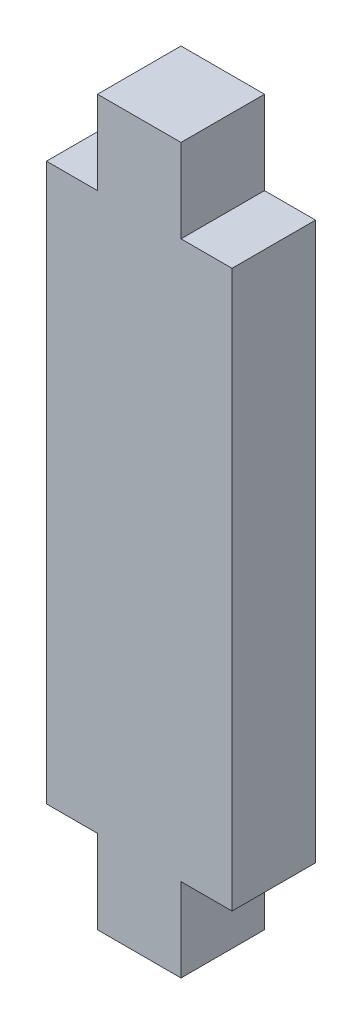
ISO-10303-21;
HEADER;
FILE_DESCRIPTION(('STEP AP214'),'2;1');
FILE_NAME('part.step','',(''),(''),'','','');
FILE_SCHEMA(('AUTOMOTIVE_DESIGN { 1 0 10303 214 1 1 1 1 }'));
ENDSEC;
DATA;
#1=APPLICATION_CONTEXT('core data for automotive mechanical design processes');
#2=APPLICATION_PROTOCOL_DEFINITION('international standard','automotive_design',2000,#1);
#3=PRODUCT_CONTEXT('',#1,'mechanical');
#4=PRODUCT('Part','Part','',(#3));
#5=PRODUCT_RELATED_PRODUCT_CATEGORY('part','',(#4));
#6=PRODUCT_DEFINITION_FORMATION('','',#4);
#7=PRODUCT_DEFINITION_CONTEXT('part definition',#1,'design');
#8=PRODUCT_DEFINITION('design','',#6,#7);
#9=PRODUCT_DEFINITION_SHAPE('','',#8);
#10=(LENGTH_UNIT() NAMED_UNIT(*) SI_UNIT(.MILLI.,.METRE.));
#11=(NAMED_UNIT(*) PLANE_ANGLE_UNIT() SI_UNIT($,.RADIAN.));
#12=(NAMED_UNIT(*) SI_UNIT($,.STERADIAN.) SOLID_ANGLE_UNIT());
#13=UNCERTAINTY_MEASURE_WITH_UNIT(LENGTH_MEASURE(1.E-05),#10,'distance_accuracy_value','');
#14=(GEOMETRIC_REPRESENTATION_CONTEXT(3) GLOBAL_UNCERTAINTY_ASSIGNED_CONTEXT((#13)) GLOBAL_UNIT_ASSIGNED_CONTEXT((#10,
#11,#12)) REPRESENTATION_CONTEXT('',''));
#15=CARTESIAN_POINT('',(0.,0.,0.));
#16=DIRECTION('',(0.,0.,1.));
#17=DIRECTION('',(1.,0.,0.));
#18=AXIS2_PLACEMENT_3D('',#15,#16,#17);
#19=CARTESIAN_POINT('',(2.25,0.,-2.25));
#20=DIRECTION('',(-1.,0.,0.));
#21=DIRECTION('',(0.,-1.,0.));
#22=AXIS2_PLACEMENT_3D('',#19,#20,#21);
#23=PLANE('',#22);
#24=DIRECTION('',(0.,-1.,0.));
#25=VECTOR('',#24,1.);
#26=CARTESIAN_POINT('',(2.25,0.,2.25));
#27=LINE('',#26,#25);
#28=CARTESIAN_POINT('',(2.25,19.5,2.25));
#29=VERTEX_POINT('',#28);
#30=CARTESIAN_POINT('',(2.25,15.,2.25));
#31=VERTEX_POINT('',#30);
#32=EDGE_CURVE('E130',#29,#31,#27,.T.);
#33=ORIENTED_EDGE('',*,*,#32,.T.);
#34=DIRECTION('',(0.,0.,1.));
#35=VECTOR('',#34,1.);
#36=CARTESIAN_POINT('',(2.25,15.,-2.25));
#37=LINE('',#36,#35);
#38=CARTESIAN_POINT('',(2.25,15.,-2.25));
#39=VERTEX_POINT('',#38);
#40=EDGE_CURVE('E11',#39,#31,#37,.T.);
#41=ORIENTED_EDGE('',*,*,#40,.F.);
#42=DIRECTION('',(0.,-1.,0.));
#43=VECTOR('',#42,1.);
#44=CARTESIAN_POINT('',(2.25,0.,-2.25));
#45=LINE('',#44,#43);
#46=CARTESIAN_POINT('',(2.25,19.5,-2.25));
#47=VERTEX_POINT('',#46);
#48=EDGE_CURVE('E156',#47,#39,#45,.T.);
#49=ORIENTED_EDGE('',*,*,#48,.F.);
#50=DIRECTION('',(0.,0.,1.));
#51=VECTOR('',#50,1.);
#52=CARTESIAN_POINT('',(2.25,19.5,-2.25));
#53=LINE('',#52,#51);
#54=EDGE_CURVE('E37',#47,#29,#53,.T.);
#55=ORIENTED_EDGE('',*,*,#54,.T.);
#56=EDGE_LOOP('',(#33,#41,#49,#55));
#57=FACE_BOUND('',#56,.T.);
#58=ADVANCED_FACE('F34',(#57),#23,.F.);
#59=CARTESIAN_POINT('',(0.,15.,-2.25));
#60=DIRECTION('',(0.,-1.,0.));
#61=DIRECTION('',(0.,0.,-1.));
#62=AXIS2_PLACEMENT_3D('',#59,#60,#61);
#63=PLANE('',#62);
#64=DIRECTION('',(1.,0.,0.));
#65=VECTOR('',#64,1.);
#66=CARTESIAN_POINT('',(0.,15.,2.25));
#67=LINE('',#66,#65);
#68=CARTESIAN_POINT('',(5.,15.,2.25));
#69=VERTEX_POINT('',#68);
#70=EDGE_CURVE('E72',#31,#69,#67,.T.);
#71=ORIENTED_EDGE('',*,*,#70,.T.);
#72=DIRECTION('',(0.,0.,1.));
#73=VECTOR('',#72,1.);
#74=CARTESIAN_POINT('',(5.,15.,-2.25));
#75=LINE('',#74,#73);
#76=CARTESIAN_POINT('',(5.,15.,-2.25));
#77=VERTEX_POINT('',#76);
#78=EDGE_CURVE('E43',#77,#69,#75,.T.);
#79=ORIENTED_EDGE('',*,*,#78,.F.);
#80=DIRECTION('',(1.,0.,0.));
#81=VECTOR('',#80,1.);
#82=CARTESIAN_POINT('',(0.,15.,-2.25));
#83=LINE('',#82,#81);
#84=EDGE_CURVE('E51',#39,#77,#83,.T.);
#85=ORIENTED_EDGE('',*,*,#84,.F.);
#86=ORIENTED_EDGE('',*,*,#40,.T.);
#87=EDGE_LOOP('',(#71,#79,#85,#86));
#88=FACE_BOUND('',#87,.T.);
#89=ADVANCED_FACE('F158',(#88),#63,.F.);
#90=CARTESIAN_POINT('',(5.,0.,-2.25));
#91=DIRECTION('',(-1.,0.,0.));
#92=DIRECTION('',(0.,-1.,0.));
#93=AXIS2_PLACEMENT_3D('',#90,#91,#92);
#94=PLANE('',#93);
#95=DIRECTION('',(0.,-1.,0.));
#96=VECTOR('',#95,1.);
#97=CARTESIAN_POINT('',(5.,0.,2.25));
#98=LINE('',#97,#96);
#99=CARTESIAN_POINT('',(5.,-15.,2.25));
#100=VERTEX_POINT('',#99);
#101=EDGE_CURVE('E142',#69,#100,#98,.T.);
#102=ORIENTED_EDGE('',*,*,#101,.T.);
#103=DIRECTION('',(0.,0.,1.));
#104=VECTOR('',#103,1.);
#105=CARTESIAN_POINT('',(5.,-15.,-2.25));
#106=LINE('',#105,#104);
#107=CARTESIAN_POINT('',(5.,-15.,-2.25));
#108=VERTEX_POINT('',#107);
#109=EDGE_CURVE('E162',#108,#100,#106,.T.);
#110=ORIENTED_EDGE('',*,*,#109,.F.);
#111=DIRECTION('',(0.,-1.,0.));
#112=VECTOR('',#111,1.);
#113=CARTESIAN_POINT('',(5.,0.,-2.25));
#114=LINE('',#113,#112);
#115=EDGE_CURVE('E124',#77,#108,#114,.T.);
#116=ORIENTED_EDGE('',*,*,#115,.F.);
#117=ORIENTED_EDGE('',*,*,#78,.T.);
#118=EDGE_LOOP('',(#102,#110,#116,#117));
#119=FACE_BOUND('',#118,.T.);
#120=ADVANCED_FACE('F160',(#119),#94,.F.);
#121=CARTESIAN_POINT('',(-5.,0.,-2.25));
#122=DIRECTION('',(-1.,0.,0.));
#123=DIRECTION('',(0.,-1.,0.));
#124=AXIS2_PLACEMENT_3D('',#121,#122,#123);
#125=PLANE('',#124);
#126=DIRECTION('',(0.,-1.,0.));
#127=VECTOR('',#126,1.);
#128=CARTESIAN_POINT('',(-5.,0.,2.25));
#129=LINE('',#128,#127);
#130=CARTESIAN_POINT('',(-5.,15.,2.25));
#131=VERTEX_POINT('',#130);
#132=CARTESIAN_POINT('',(-5.,-15.,2.25));
#133=VERTEX_POINT('',#132);
#134=EDGE_CURVE('E107',#131,#133,#129,.T.);
#135=ORIENTED_EDGE('',*,*,#134,.F.);
#136=DIRECTION('',(0.,0.,1.));
#137=VECTOR('',#136,1.);
#138=CARTESIAN_POINT('',(-5.,15.,-2.25));
#139=LINE('',#138,#137);
#140=CARTESIAN_POINT('',(-5.,15.,-2.25));
#141=VERTEX_POINT('',#140);
#142=EDGE_CURVE('E98',#141,#131,#139,.T.);
#143=ORIENTED_EDGE('',*,*,#142,.F.);
#144=DIRECTION('',(0.,-1.,0.));
#145=VECTOR('',#144,1.);
#146=CARTESIAN_POINT('',(-5.,0.,-2.25));
#147=LINE('',#146,#145);
#148=CARTESIAN_POINT('',(-5.,-15.,-2.25));
#149=VERTEX_POINT('',#148);
#150=EDGE_CURVE('E104',#141,#149,#147,.T.);
#151=ORIENTED_EDGE('',*,*,#150,.T.);
#152=DIRECTION('',(0.,0.,1.));
#153=VECTOR('',#152,1.);
#154=CARTESIAN_POINT('',(-5.,-15.,-2.25));
#155=LINE('',#154,#153);
#156=EDGE_CURVE('E169',#149,#133,#155,.T.);
#157=ORIENTED_EDGE('',*,*,#156,.T.);
#158=EDGE_LOOP('',(#135,#143,#151,#157));
#159=FACE_BOUND('',#158,.T.);
#160=ADVANCED_FACE('F100',(#159),#125,.T.);
#161=CARTESIAN_POINT('',(-2.25,15.,2.25));
#162=VERTEX_POINT('',#161);
#163=EDGE_CURVE('E139',#131,#162,#67,.T.);
#164=ORIENTED_EDGE('',*,*,#163,.T.);
#165=DIRECTION('',(0.,0.,1.));
#166=VECTOR('',#165,1.);
#167=CARTESIAN_POINT('',(-2.25,15.,-2.25));
#168=LINE('',#167,#166);
#169=CARTESIAN_POINT('',(-2.25,15.,-2.25));
#170=VERTEX_POINT('',#169);
#171=EDGE_CURVE('E111',#170,#162,#168,.T.);
#172=ORIENTED_EDGE('',*,*,#171,.F.);
#173=EDGE_CURVE('E114',#141,#170,#83,.T.);
#174=ORIENTED_EDGE('',*,*,#173,.F.);
#175=ORIENTED_EDGE('',*,*,#142,.T.);
#176=EDGE_LOOP('',(#164,#172,#174,#175));
#177=FACE_BOUND('',#176,.T.);
#178=ADVANCED_FACE('F115',(#177),#63,.F.);
#179=CARTESIAN_POINT('',(-2.25,0.,-2.25));
#180=DIRECTION('',(-1.,0.,0.));
#181=DIRECTION('',(0.,-1.,0.));
#182=AXIS2_PLACEMENT_3D('',#179,#180,#181);
#183=PLANE('',#182);
#184=DIRECTION('',(0.,-1.,0.));
#185=VECTOR('',#184,1.);
#186=CARTESIAN_POINT('',(-2.25,0.,2.25));
#187=LINE('',#186,#185);
#188=CARTESIAN_POINT('',(-2.25,19.5,2.25));
#189=VERTEX_POINT('',#188);
#190=EDGE_CURVE('E136',#189,#162,#187,.T.);
#191=ORIENTED_EDGE('',*,*,#190,.F.);
#192=DIRECTION('',(0.,0.,1.));
#193=VECTOR('',#192,1.);
#194=CARTESIAN_POINT('',(-2.25,19.5,-2.25));
#195=LINE('',#194,#193);
#196=CARTESIAN_POINT('',(-2.25,19.5,-2.25));
#197=VERTEX_POINT('',#196);
#198=EDGE_CURVE('E146',#197,#189,#195,.T.);
#199=ORIENTED_EDGE('',*,*,#198,.F.);
#200=DIRECTION('',(0.,-1.,0.));
#201=VECTOR('',#200,1.);
#202=CARTESIAN_POINT('',(-2.25,0.,-2.25));
#203=LINE('',#202,#201);
#204=EDGE_CURVE('E117',#197,#170,#203,.T.);
#205=ORIENTED_EDGE('',*,*,#204,.T.);
#206=ORIENTED_EDGE('',*,*,#171,.T.);
#207=EDGE_LOOP('',(#191,#199,#205,#206));
#208=FACE_BOUND('',#207,.T.);
#209=ADVANCED_FACE('F209',(#208),#183,.T.);
#210=CARTESIAN_POINT('',(0.,19.5,-2.25));
#211=DIRECTION('',(0.,-1.,0.));
#212=DIRECTION('',(0.,0.,-1.));
#213=AXIS2_PLACEMENT_3D('',#210,#211,#212);
#214=PLANE('',#213);
#215=DIRECTION('',(1.,0.,0.));
#216=VECTOR('',#215,1.);
#217=CARTESIAN_POINT('',(0.,19.5,2.25));
#218=LINE('',#217,#216);
#219=EDGE_CURVE('E133',#189,#29,#218,.T.);
#220=ORIENTED_EDGE('',*,*,#219,.T.);
#221=ORIENTED_EDGE('',*,*,#54,.F.);
#222=DIRECTION('',(1.,0.,0.));
#223=VECTOR('',#222,1.);
#224=CARTESIAN_POINT('',(0.,19.5,-2.25));
#225=LINE('',#224,#223);
#226=EDGE_CURVE('E84',#197,#47,#225,.T.);
#227=ORIENTED_EDGE('',*,*,#226,.F.);
#228=ORIENTED_EDGE('',*,*,#198,.T.);
#229=EDGE_LOOP('',(#220,#221,#227,#228));
#230=FACE_BOUND('',#229,.T.);
#231=ADVANCED_FACE('F210',(#230),#214,.F.);
#232=CARTESIAN_POINT('',(0.,0.,-2.25));
#233=DIRECTION('',(0.,0.,1.));
#234=DIRECTION('',(1.,0.,0.));
#235=AXIS2_PLACEMENT_3D('',#232,#233,#234);
#236=PLANE('',#235);
#237=ORIENTED_EDGE('',*,*,#48,.T.);
#238=ORIENTED_EDGE('',*,*,#84,.T.);
#239=ORIENTED_EDGE('',*,*,#115,.T.);
#240=DIRECTION('',(1.,0.,0.));
#241=VECTOR('',#240,1.);
#242=CARTESIAN_POINT('',(0.,-15.,-2.25));
#243=LINE('',#242,#241);
#244=CARTESIAN_POINT('',(2.25,-15.,-2.25));
#245=VERTEX_POINT('',#244);
#246=EDGE_CURVE('E172',#245,#108,#243,.T.);
#247=ORIENTED_EDGE('',*,*,#246,.F.);
#248=DIRECTION('',(0.,1.,0.));
#249=VECTOR('',#248,1.);
#250=CARTESIAN_POINT('',(2.25,0.,-2.25));
#251=LINE('',#250,#249);
#252=CARTESIAN_POINT('',(2.25,-19.5,-2.25));
#253=VERTEX_POINT('',#252);
#254=EDGE_CURVE('E245',#253,#245,#251,.T.);
#255=ORIENTED_EDGE('',*,*,#254,.F.);
#256=DIRECTION('',(1.,0.,0.));
#257=VECTOR('',#256,1.);
#258=CARTESIAN_POINT('',(0.,-19.5,-2.25));
#259=LINE('',#258,#257);
#260=CARTESIAN_POINT('',(-2.25,-19.5,-2.25));
#261=VERTEX_POINT('',#260);
#262=EDGE_CURVE('E241',#261,#253,#259,.T.);
#263=ORIENTED_EDGE('',*,*,#262,.F.);
#264=DIRECTION('',(0.,1.,0.));
#265=VECTOR('',#264,1.);
#266=CARTESIAN_POINT('',(-2.25,0.,-2.25));
#267=LINE('',#266,#265);
#268=CARTESIAN_POINT('',(-2.25,-15.,-2.25));
#269=VERTEX_POINT('',#268);
#270=EDGE_CURVE('E182',#261,#269,#267,.T.);
#271=ORIENTED_EDGE('',*,*,#270,.T.);
#272=EDGE_CURVE('E122',#149,#269,#243,.T.);
#273=ORIENTED_EDGE('',*,*,#272,.F.);
#274=ORIENTED_EDGE('',*,*,#150,.F.);
#275=ORIENTED_EDGE('',*,*,#173,.T.);
#276=ORIENTED_EDGE('',*,*,#204,.F.);
#277=ORIENTED_EDGE('',*,*,#226,.T.);
#278=EDGE_LOOP('',(#237,#238,#239,#247,#255,#263,#271,#273,#274,#275,#276,#277));
#279=FACE_BOUND('',#278,.T.);
#280=ADVANCED_FACE('F119',(#279),#236,.F.);
#281=CARTESIAN_POINT('',(0.,0.,2.25));
#282=DIRECTION('',(0.,0.,1.));
#283=DIRECTION('',(1.,0.,0.));
#284=AXIS2_PLACEMENT_3D('',#281,#282,#283);
#285=PLANE('',#284);
#286=ORIENTED_EDGE('',*,*,#32,.F.);
#287=ORIENTED_EDGE('',*,*,#219,.F.);
#288=ORIENTED_EDGE('',*,*,#190,.T.);
#289=ORIENTED_EDGE('',*,*,#163,.F.);
#290=ORIENTED_EDGE('',*,*,#134,.T.);
#291=DIRECTION('',(1.,0.,0.));
#292=VECTOR('',#291,1.);
#293=CARTESIAN_POINT('',(0.,-15.,2.25));
#294=LINE('',#293,#292);
#295=CARTESIAN_POINT('',(-2.25,-15.,2.25));
#296=VERTEX_POINT('',#295);
#297=EDGE_CURVE('E195',#133,#296,#294,.T.);
#298=ORIENTED_EDGE('',*,*,#297,.T.);
#299=DIRECTION('',(0.,1.,0.));
#300=VECTOR('',#299,1.);
#301=CARTESIAN_POINT('',(-2.25,0.,2.25));
#302=LINE('',#301,#300);
#303=CARTESIAN_POINT('',(-2.25,-19.5,2.25));
#304=VERTEX_POINT('',#303);
#305=EDGE_CURVE('E192',#304,#296,#302,.T.);
#306=ORIENTED_EDGE('',*,*,#305,.F.);
#307=DIRECTION('',(1.,0.,0.));
#308=VECTOR('',#307,1.);
#309=CARTESIAN_POINT('',(0.,-19.5,2.25));
#310=LINE('',#309,#308);
#311=CARTESIAN_POINT('',(2.25,-19.5,2.25));
#312=VERTEX_POINT('',#311);
#313=EDGE_CURVE('E189',#304,#312,#310,.T.);
#314=ORIENTED_EDGE('',*,*,#313,.T.);
#315=DIRECTION('',(0.,1.,0.));
#316=VECTOR('',#315,1.);
#317=CARTESIAN_POINT('',(2.25,0.,2.25));
#318=LINE('',#317,#316);
#319=CARTESIAN_POINT('',(2.25,-15.,2.25));
#320=VERTEX_POINT('',#319);
#321=EDGE_CURVE('E186',#312,#320,#318,.T.);
#322=ORIENTED_EDGE('',*,*,#321,.T.);
#323=EDGE_CURVE('E198',#320,#100,#294,.T.);
#324=ORIENTED_EDGE('',*,*,#323,.T.);
#325=ORIENTED_EDGE('',*,*,#101,.F.);
#326=ORIENTED_EDGE('',*,*,#70,.F.);
#327=EDGE_LOOP('',(#286,#287,#288,#289,#290,#298,#306,#314,#322,#324,#325,#326));
#328=FACE_BOUND('',#327,.T.);
#329=ADVANCED_FACE('F211',(#328),#285,.T.);
#330=CARTESIAN_POINT('',(2.25,0.,-2.25));
#331=DIRECTION('',(-1.,0.,0.));
#332=DIRECTION('',(0.,1.,0.));
#333=AXIS2_PLACEMENT_3D('',#330,#331,#332);
#334=PLANE('',#333);
#335=ORIENTED_EDGE('',*,*,#321,.F.);
#336=DIRECTION('',(0.,0.,1.));
#337=VECTOR('',#336,1.);
#338=CARTESIAN_POINT('',(2.25,-19.5,-2.25));
#339=LINE('',#338,#337);
#340=EDGE_CURVE('E177',#253,#312,#339,.T.);
#341=ORIENTED_EDGE('',*,*,#340,.F.);
#342=ORIENTED_EDGE('',*,*,#254,.T.);
#343=DIRECTION('',(0.,0.,1.));
#344=VECTOR('',#343,1.);
#345=CARTESIAN_POINT('',(2.25,-15.,-2.25));
#346=LINE('',#345,#344);
#347=EDGE_CURVE('E134',#245,#320,#346,.T.);
#348=ORIENTED_EDGE('',*,*,#347,.T.);
#349=EDGE_LOOP('',(#335,#341,#342,#348));
#350=FACE_BOUND('',#349,.T.);
#351=ADVANCED_FACE('F248',(#350),#334,.F.);
#352=CARTESIAN_POINT('',(0.,-15.,-2.25));
#353=DIRECTION('',(0.,1.,0.));
#354=DIRECTION('',(0.,0.,-1.));
#355=AXIS2_PLACEMENT_3D('',#352,#353,#354);
#356=PLANE('',#355);
#357=ORIENTED_EDGE('',*,*,#323,.F.);
#358=ORIENTED_EDGE('',*,*,#347,.F.);
#359=ORIENTED_EDGE('',*,*,#246,.T.);
#360=ORIENTED_EDGE('',*,*,#109,.T.);
#361=EDGE_LOOP('',(#357,#358,#359,#360));
#362=FACE_BOUND('',#361,.T.);
#363=ADVANCED_FACE('F173',(#362),#356,.F.);
#364=ORIENTED_EDGE('',*,*,#297,.F.);
#365=ORIENTED_EDGE('',*,*,#156,.F.);
#366=ORIENTED_EDGE('',*,*,#272,.T.);
#367=DIRECTION('',(0.,0.,1.));
#368=VECTOR('',#367,1.);
#369=CARTESIAN_POINT('',(-2.25,-15.,-2.25));
#370=LINE('',#369,#368);
#371=EDGE_CURVE('E201',#269,#296,#370,.T.);
#372=ORIENTED_EDGE('',*,*,#371,.T.);
#373=EDGE_LOOP('',(#364,#365,#366,#372));
#374=FACE_BOUND('',#373,.T.);
#375=ADVANCED_FACE('F218',(#374),#356,.F.);
#376=CARTESIAN_POINT('',(-2.25,0.,-2.25));
#377=DIRECTION('',(-1.,0.,0.));
#378=DIRECTION('',(0.,1.,0.));
#379=AXIS2_PLACEMENT_3D('',#376,#377,#378);
#380=PLANE('',#379);
#381=ORIENTED_EDGE('',*,*,#305,.T.);
#382=ORIENTED_EDGE('',*,*,#371,.F.);
#383=ORIENTED_EDGE('',*,*,#270,.F.);
#384=DIRECTION('',(0.,0.,1.));
#385=VECTOR('',#384,1.);
#386=CARTESIAN_POINT('',(-2.25,-19.5,-2.25));
#387=LINE('',#386,#385);
#388=EDGE_CURVE('E180',#261,#304,#387,.T.);
#389=ORIENTED_EDGE('',*,*,#388,.T.);
#390=EDGE_LOOP('',(#381,#382,#383,#389));
#391=FACE_BOUND('',#390,.T.);
#392=ADVANCED_FACE('F225',(#391),#380,.T.);
#393=CARTESIAN_POINT('',(0.,-19.5,-2.25));
#394=DIRECTION('',(0.,1.,0.));
#395=DIRECTION('',(0.,0.,-1.));
#396=AXIS2_PLACEMENT_3D('',#393,#394,#395);
#397=PLANE('',#396);
#398=ORIENTED_EDGE('',*,*,#313,.F.);
#399=ORIENTED_EDGE('',*,*,#388,.F.);
#400=ORIENTED_EDGE('',*,*,#262,.T.);
#401=ORIENTED_EDGE('',*,*,#340,.T.);
#402=EDGE_LOOP('',(#398,#399,#400,#401));
#403=FACE_BOUND('',#402,.T.);
#404=ADVANCED_FACE('F242',(#403),#397,.F.);
#405=CLOSED_SHELL('',(#58,#89,#120,#160,#178,#209,#231,#280,#329,#351,#363,#375,#392,#404));
#406=MANIFOLD_SOLID_BREP('B2',#405);
#407=ADVANCED_BREP_SHAPE_REPRESENTATION('',(#18,#406),#14);
#408=SHAPE_DEFINITION_REPRESENTATION(#9,#407);
ENDSEC;
END-ISO-10303-21;
